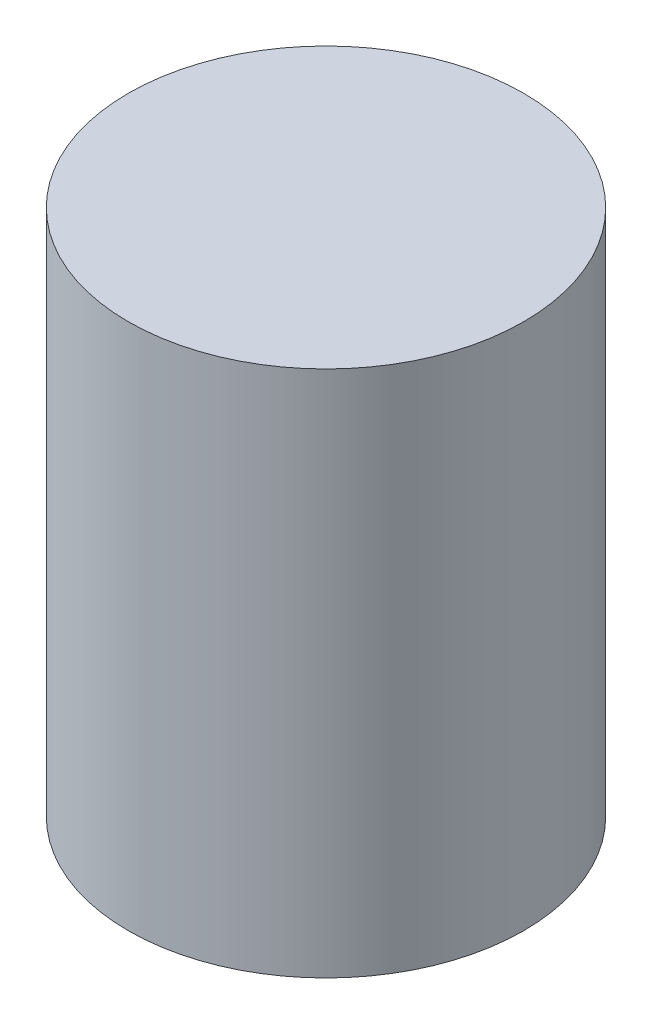
ISO-10303-21;
HEADER;
FILE_DESCRIPTION(('STEP AP214'),'2;1');
FILE_NAME('part.step','',(''),(''),'','','');
FILE_SCHEMA(('AUTOMOTIVE_DESIGN { 1 0 10303 214 1 1 1 1 }'));
ENDSEC;
DATA;
#1=APPLICATION_CONTEXT('core data for automotive mechanical design processes');
#2=APPLICATION_PROTOCOL_DEFINITION('international standard','automotive_design',2000,#1);
#3=PRODUCT_CONTEXT('',#1,'mechanical');
#4=PRODUCT('Part','Part','',(#3));
#5=PRODUCT_RELATED_PRODUCT_CATEGORY('part','',(#4));
#6=PRODUCT_DEFINITION_FORMATION('','',#4);
#7=PRODUCT_DEFINITION_CONTEXT('part definition',#1,'design');
#8=PRODUCT_DEFINITION('design','',#6,#7);
#9=PRODUCT_DEFINITION_SHAPE('','',#8);
#10=(LENGTH_UNIT() NAMED_UNIT(*) SI_UNIT(.MILLI.,.METRE.));
#11=(NAMED_UNIT(*) PLANE_ANGLE_UNIT() SI_UNIT($,.RADIAN.));
#12=(NAMED_UNIT(*) SI_UNIT($,.STERADIAN.) SOLID_ANGLE_UNIT());
#13=UNCERTAINTY_MEASURE_WITH_UNIT(LENGTH_MEASURE(1.E-05),#10,'distance_accuracy_value','');
#14=(GEOMETRIC_REPRESENTATION_CONTEXT(3) GLOBAL_UNCERTAINTY_ASSIGNED_CONTEXT((#13)) GLOBAL_UNIT_ASSIGNED_CONTEXT((#10,
#11,#12)) REPRESENTATION_CONTEXT('',''));
#15=CARTESIAN_POINT('',(0.,0.,0.));
#16=DIRECTION('',(0.,0.,1.));
#17=DIRECTION('',(1.,0.,0.));
#18=AXIS2_PLACEMENT_3D('',#15,#16,#17);
#19=CARTESIAN_POINT('',(0.,20.,0.));
#20=DIRECTION('',(0.,-1.,0.));
#21=DIRECTION('',(0.,0.,-1.));
#22=AXIS2_PLACEMENT_3D('',#19,#20,#21);
#23=CYLINDRICAL_SURFACE('',#22,7.5);
#24=CARTESIAN_POINT('',(0.,20.,0.));
#25=DIRECTION('',(0.,1.,0.));
#26=DIRECTION('',(0.,0.,1.));
#27=AXIS2_PLACEMENT_3D('',#24,#25,#26);
#28=CIRCLE('',#27,7.5);
#29=CARTESIAN_POINT('',(0.,20.,7.5));
#30=VERTEX_POINT('',#29);
#31=EDGE_CURVE('E10',#30,#30,#28,.T.);
#32=ORIENTED_EDGE('',*,*,#31,.F.);
#33=EDGE_LOOP('',(#32));
#34=FACE_BOUND('',#33,.T.);
#35=CARTESIAN_POINT('',(0.,0.,0.));
#36=DIRECTION('',(0.,1.,0.));
#37=DIRECTION('',(0.,0.,1.));
#38=AXIS2_PLACEMENT_3D('',#35,#36,#37);
#39=CIRCLE('',#38,7.5);
#40=CARTESIAN_POINT('',(0.,0.,7.5));
#41=VERTEX_POINT('',#40);
#42=EDGE_CURVE('E46',#41,#41,#39,.T.);
#43=ORIENTED_EDGE('',*,*,#42,.T.);
#44=EDGE_LOOP('',(#43));
#45=FACE_BOUND('',#44,.T.);
#46=ADVANCED_FACE('F43',(#34,#45),#23,.T.);
#47=CARTESIAN_POINT('',(0.,20.,0.));
#48=DIRECTION('',(0.,1.,0.));
#49=DIRECTION('',(0.,0.,1.));
#50=AXIS2_PLACEMENT_3D('',#47,#48,#49);
#51=PLANE('',#50);
#52=ORIENTED_EDGE('',*,*,#31,.T.);
#53=EDGE_LOOP('',(#52));
#54=FACE_BOUND('',#53,.T.);
#55=ADVANCED_FACE('F60',(#54),#51,.T.);
#56=CARTESIAN_POINT('',(0.,0.,0.));
#57=DIRECTION('',(0.,1.,0.));
#58=DIRECTION('',(0.,0.,1.));
#59=AXIS2_PLACEMENT_3D('',#56,#57,#58);
#60=PLANE('',#59);
#61=ORIENTED_EDGE('',*,*,#42,.F.);
#62=EDGE_LOOP('',(#61));
#63=FACE_BOUND('',#62,.T.);
#64=ADVANCED_FACE('F58',(#63),#60,.F.);
#65=CLOSED_SHELL('',(#46,#55,#64));
#66=MANIFOLD_SOLID_BREP('B2',#65);
#67=ADVANCED_BREP_SHAPE_REPRESENTATION('',(#18,#66),#14);
#68=SHAPE_DEFINITION_REPRESENTATION(#9,#67);
ENDSEC;
END-ISO-10303-21;
